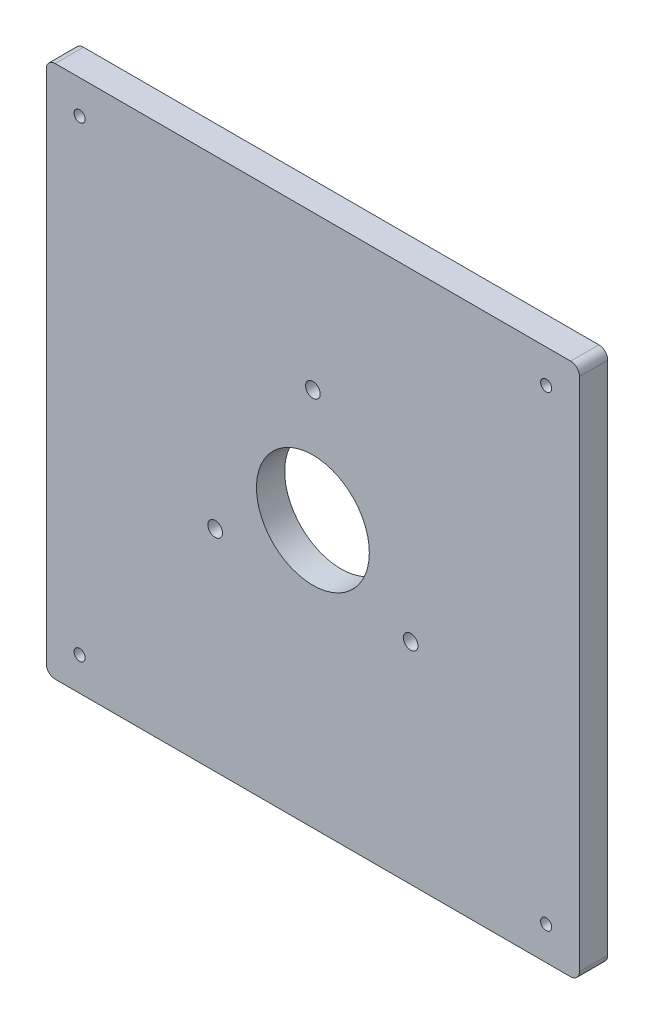
ISO-10303-21;
HEADER;
FILE_DESCRIPTION(('STEP AP214'),'2;1');
FILE_NAME('part.step','',(''),(''),'','','');
FILE_SCHEMA(('AUTOMOTIVE_DESIGN { 1 0 10303 214 1 1 1 1 }'));
ENDSEC;
DATA;
#1=APPLICATION_CONTEXT('core data for automotive mechanical design processes');
#2=APPLICATION_PROTOCOL_DEFINITION('international standard','automotive_design',2000,#1);
#3=PRODUCT_CONTEXT('',#1,'mechanical');
#4=PRODUCT('Part','Part','',(#3));
#5=PRODUCT_RELATED_PRODUCT_CATEGORY('part','',(#4));
#6=PRODUCT_DEFINITION_FORMATION('','',#4);
#7=PRODUCT_DEFINITION_CONTEXT('part definition',#1,'design');
#8=PRODUCT_DEFINITION('design','',#6,#7);
#9=PRODUCT_DEFINITION_SHAPE('','',#8);
#10=(LENGTH_UNIT() NAMED_UNIT(*) SI_UNIT(.MILLI.,.METRE.));
#11=(NAMED_UNIT(*) PLANE_ANGLE_UNIT() SI_UNIT($,.RADIAN.));
#12=(NAMED_UNIT(*) SI_UNIT($,.STERADIAN.) SOLID_ANGLE_UNIT());
#13=UNCERTAINTY_MEASURE_WITH_UNIT(LENGTH_MEASURE(1.E-05),#10,'distance_accuracy_value','');
#14=(GEOMETRIC_REPRESENTATION_CONTEXT(3) GLOBAL_UNCERTAINTY_ASSIGNED_CONTEXT((#13)) GLOBAL_UNIT_ASSIGNED_CONTEXT((#10,
#11,#12)) REPRESENTATION_CONTEXT('',''));
#15=CARTESIAN_POINT('',(0.,0.,0.));
#16=DIRECTION('',(0.,0.,1.));
#17=DIRECTION('',(1.,0.,0.));
#18=AXIS2_PLACEMENT_3D('',#15,#16,#17);
#19=CARTESIAN_POINT('',(0.,0.,6.35));
#20=DIRECTION('',(0.,0.,-1.));
#21=DIRECTION('',(-1.,0.,0.));
#22=AXIS2_PLACEMENT_3D('',#19,#20,#21);
#23=PLANE('',#22);
#24=CARTESIAN_POINT('',(81.9970452561247,47.2999999999999,6.35));
#25=DIRECTION('',(0.,0.,1.));
#26=DIRECTION('',(1.,0.,0.));
#27=AXIS2_PLACEMENT_3D('',#24,#25,#26);
#28=CIRCLE('',#27,1.65000000000001);
#29=CARTESIAN_POINT('',(83.6470452561247,47.2999999999999,6.35));
#30=VERTEX_POINT('',#29);
#31=EDGE_CURVE('E365',#30,#30,#28,.T.);
#32=ORIENTED_EDGE('',*,*,#31,.F.);
#33=EDGE_LOOP('',(#32));
#34=FACE_BOUND('',#33,.T.);
#35=CARTESIAN_POINT('',(38.0029547438753,47.2999999999999,6.35));
#36=DIRECTION('',(0.,0.,1.));
#37=DIRECTION('',(1.,0.,0.));
#38=AXIS2_PLACEMENT_3D('',#35,#36,#37);
#39=CIRCLE('',#38,1.65);
#40=CARTESIAN_POINT('',(39.6529547438753,47.2999999999999,6.35));
#41=VERTEX_POINT('',#40);
#42=EDGE_CURVE('E366',#41,#41,#39,.T.);
#43=ORIENTED_EDGE('',*,*,#42,.F.);
#44=EDGE_LOOP('',(#43));
#45=FACE_BOUND('',#44,.T.);
#46=CARTESIAN_POINT('',(60.,85.4,6.35));
#47=DIRECTION('',(0.,0.,1.));
#48=DIRECTION('',(1.,0.,0.));
#49=AXIS2_PLACEMENT_3D('',#46,#47,#48);
#50=CIRCLE('',#49,1.65);
#51=CARTESIAN_POINT('',(61.65,85.4,6.35));
#52=VERTEX_POINT('',#51);
#53=EDGE_CURVE('E374',#52,#52,#50,.T.);
#54=ORIENTED_EDGE('',*,*,#53,.F.);
#55=EDGE_LOOP('',(#54));
#56=FACE_BOUND('',#55,.T.);
#57=DIRECTION('',(0.,-1.,0.));
#58=VECTOR('',#57,1.);
#59=CARTESIAN_POINT('',(0.,0.,6.35));
#60=LINE('',#59,#58);
#61=CARTESIAN_POINT('',(0.,118.,6.35));
#62=VERTEX_POINT('',#61);
#63=CARTESIAN_POINT('',(0.,2.,6.35));
#64=VERTEX_POINT('',#63);
#65=EDGE_CURVE('E138',#62,#64,#60,.T.);
#66=ORIENTED_EDGE('',*,*,#65,.T.);
#67=CARTESIAN_POINT('',(2.,2.,6.35));
#68=DIRECTION('',(0.,0.,-1.));
#69=DIRECTION('',(-1.,0.,0.));
#70=AXIS2_PLACEMENT_3D('',#67,#68,#69);
#71=CIRCLE('',#70,2.);
#72=CARTESIAN_POINT('',(2.,0.,6.35));
#73=VERTEX_POINT('',#72);
#74=EDGE_CURVE('E153',#64,#73,#71,.F.);
#75=ORIENTED_EDGE('',*,*,#74,.T.);
#76=DIRECTION('',(1.,0.,0.));
#77=VECTOR('',#76,1.);
#78=CARTESIAN_POINT('',(0.,0.,6.35));
#79=LINE('',#78,#77);
#80=CARTESIAN_POINT('',(118.,0.,6.35));
#81=VERTEX_POINT('',#80);
#82=EDGE_CURVE('E120',#73,#81,#79,.T.);
#83=ORIENTED_EDGE('',*,*,#82,.T.);
#84=CARTESIAN_POINT('',(118.,2.,6.35));
#85=DIRECTION('',(0.,0.,-1.));
#86=DIRECTION('',(-1.,0.,0.));
#87=AXIS2_PLACEMENT_3D('',#84,#85,#86);
#88=CIRCLE('',#87,2.);
#89=CARTESIAN_POINT('',(120.,2.,6.35));
#90=VERTEX_POINT('',#89);
#91=EDGE_CURVE('E151',#81,#90,#88,.F.);
#92=ORIENTED_EDGE('',*,*,#91,.T.);
#93=DIRECTION('',(0.,1.,0.));
#94=VECTOR('',#93,1.);
#95=CARTESIAN_POINT('',(120.,0.,6.35));
#96=LINE('',#95,#94);
#97=CARTESIAN_POINT('',(120.,118.,6.35));
#98=VERTEX_POINT('',#97);
#99=EDGE_CURVE('E173',#90,#98,#96,.T.);
#100=ORIENTED_EDGE('',*,*,#99,.T.);
#101=CARTESIAN_POINT('',(118.,118.,6.35));
#102=DIRECTION('',(0.,0.,-1.));
#103=DIRECTION('',(-1.,0.,0.));
#104=AXIS2_PLACEMENT_3D('',#101,#102,#103);
#105=CIRCLE('',#104,2.);
#106=CARTESIAN_POINT('',(118.,120.,6.35));
#107=VERTEX_POINT('',#106);
#108=EDGE_CURVE('E55',#98,#107,#105,.F.);
#109=ORIENTED_EDGE('',*,*,#108,.T.);
#110=DIRECTION('',(-1.,0.,0.));
#111=VECTOR('',#110,1.);
#112=CARTESIAN_POINT('',(0.,120.,6.35));
#113=LINE('',#112,#111);
#114=CARTESIAN_POINT('',(2.,120.,6.35));
#115=VERTEX_POINT('',#114);
#116=EDGE_CURVE('E139',#107,#115,#113,.T.);
#117=ORIENTED_EDGE('',*,*,#116,.T.);
#118=CARTESIAN_POINT('',(2.,118.,6.35));
#119=DIRECTION('',(0.,0.,-1.));
#120=DIRECTION('',(-1.,0.,0.));
#121=AXIS2_PLACEMENT_3D('',#118,#119,#120);
#122=CIRCLE('',#121,2.);
#123=EDGE_CURVE('E149',#115,#62,#122,.F.);
#124=ORIENTED_EDGE('',*,*,#123,.T.);
#125=EDGE_LOOP('',(#66,#75,#83,#92,#100,#109,#117,#124));
#126=FACE_BOUND('',#125,.T.);
#127=CARTESIAN_POINT('',(7.5,112.5,6.35));
#128=DIRECTION('',(0.,0.,1.));
#129=DIRECTION('',(1.,0.,0.));
#130=AXIS2_PLACEMENT_3D('',#127,#128,#129);
#131=CIRCLE('',#130,1.25);
#132=CARTESIAN_POINT('',(8.75,112.5,6.35));
#133=VERTEX_POINT('',#132);
#134=EDGE_CURVE('E133',#133,#133,#131,.T.);
#135=ORIENTED_EDGE('',*,*,#134,.F.);
#136=EDGE_LOOP('',(#135));
#137=FACE_BOUND('',#136,.T.);
#138=CARTESIAN_POINT('',(112.5,112.5,6.35));
#139=DIRECTION('',(0.,0.,1.));
#140=DIRECTION('',(-1.,0.,0.));
#141=AXIS2_PLACEMENT_3D('',#138,#139,#140);
#142=CIRCLE('',#141,1.24999999999998);
#143=CARTESIAN_POINT('',(111.25,112.5,6.35));
#144=VERTEX_POINT('',#143);
#145=EDGE_CURVE('E189',#144,#144,#142,.T.);
#146=ORIENTED_EDGE('',*,*,#145,.F.);
#147=EDGE_LOOP('',(#146));
#148=FACE_BOUND('',#147,.T.);
#149=CARTESIAN_POINT('',(112.5,7.49999999999999,6.35));
#150=DIRECTION('',(0.,0.,1.));
#151=DIRECTION('',(1.,0.,0.));
#152=AXIS2_PLACEMENT_3D('',#149,#150,#151);
#153=CIRCLE('',#152,1.24999999999998);
#154=CARTESIAN_POINT('',(113.75,7.49999999999999,6.35));
#155=VERTEX_POINT('',#154);
#156=EDGE_CURVE('E193',#155,#155,#153,.T.);
#157=ORIENTED_EDGE('',*,*,#156,.F.);
#158=EDGE_LOOP('',(#157));
#159=FACE_BOUND('',#158,.T.);
#160=CARTESIAN_POINT('',(7.5,7.49999999999999,6.35));
#161=DIRECTION('',(0.,0.,1.));
#162=DIRECTION('',(-1.,0.,0.));
#163=AXIS2_PLACEMENT_3D('',#160,#161,#162);
#164=CIRCLE('',#163,1.25);
#165=CARTESIAN_POINT('',(6.25,7.49999999999999,6.35));
#166=VERTEX_POINT('',#165);
#167=EDGE_CURVE('E197',#166,#166,#164,.T.);
#168=ORIENTED_EDGE('',*,*,#167,.F.);
#169=EDGE_LOOP('',(#168));
#170=FACE_BOUND('',#169,.T.);
#171=CARTESIAN_POINT('',(60.,60.,6.35));
#172=DIRECTION('',(0.,0.,1.));
#173=DIRECTION('',(1.,0.,0.));
#174=AXIS2_PLACEMENT_3D('',#171,#172,#173);
#175=CIRCLE('',#174,12.7);
#176=CARTESIAN_POINT('',(72.7,60.,6.35));
#177=VERTEX_POINT('',#176);
#178=EDGE_CURVE('E200',#177,#177,#175,.T.);
#179=ORIENTED_EDGE('',*,*,#178,.F.);
#180=EDGE_LOOP('',(#179));
#181=FACE_BOUND('',#180,.T.);
#182=ADVANCED_FACE('F35',(#34,#45,#56,#126,#137,#148,#159,#170,#181),#23,.F.);
#183=CARTESIAN_POINT('',(0.,0.,0.));
#184=DIRECTION('',(0.,0.,-1.));
#185=DIRECTION('',(-1.,0.,0.));
#186=AXIS2_PLACEMENT_3D('',#183,#184,#185);
#187=PLANE('',#186);
#188=CARTESIAN_POINT('',(81.9970452561247,47.2999999999999,0.));
#189=DIRECTION('',(0.,0.,1.));
#190=DIRECTION('',(1.,0.,0.));
#191=AXIS2_PLACEMENT_3D('',#188,#189,#190);
#192=CIRCLE('',#191,1.65000000000001);
#193=CARTESIAN_POINT('',(83.6470452561247,47.2999999999999,0.));
#194=VERTEX_POINT('',#193);
#195=EDGE_CURVE('E208',#194,#194,#192,.T.);
#196=ORIENTED_EDGE('',*,*,#195,.T.);
#197=EDGE_LOOP('',(#196));
#198=FACE_BOUND('',#197,.T.);
#199=CARTESIAN_POINT('',(38.0029547438753,47.2999999999999,0.));
#200=DIRECTION('',(0.,0.,1.));
#201=DIRECTION('',(1.,0.,0.));
#202=AXIS2_PLACEMENT_3D('',#199,#200,#201);
#203=CIRCLE('',#202,1.65);
#204=CARTESIAN_POINT('',(39.6529547438753,47.2999999999999,0.));
#205=VERTEX_POINT('',#204);
#206=EDGE_CURVE('E370',#205,#205,#203,.T.);
#207=ORIENTED_EDGE('',*,*,#206,.T.);
#208=EDGE_LOOP('',(#207));
#209=FACE_BOUND('',#208,.T.);
#210=CARTESIAN_POINT('',(60.,85.4,0.));
#211=DIRECTION('',(0.,0.,1.));
#212=DIRECTION('',(1.,0.,0.));
#213=AXIS2_PLACEMENT_3D('',#210,#211,#212);
#214=CIRCLE('',#213,1.65);
#215=CARTESIAN_POINT('',(61.65,85.4,0.));
#216=VERTEX_POINT('',#215);
#217=EDGE_CURVE('E211',#216,#216,#214,.T.);
#218=ORIENTED_EDGE('',*,*,#217,.T.);
#219=EDGE_LOOP('',(#218));
#220=FACE_BOUND('',#219,.T.);
#221=CARTESIAN_POINT('',(7.5,7.49999999999999,0.));
#222=DIRECTION('',(0.,0.,1.));
#223=DIRECTION('',(-1.,0.,0.));
#224=AXIS2_PLACEMENT_3D('',#221,#222,#223);
#225=CIRCLE('',#224,1.25);
#226=CARTESIAN_POINT('',(6.25,7.49999999999999,0.));
#227=VERTEX_POINT('',#226);
#228=EDGE_CURVE('E202',#227,#227,#225,.T.);
#229=ORIENTED_EDGE('',*,*,#228,.T.);
#230=EDGE_LOOP('',(#229));
#231=FACE_BOUND('',#230,.T.);
#232=CARTESIAN_POINT('',(112.5,112.5,0.));
#233=DIRECTION('',(0.,0.,1.));
#234=DIRECTION('',(-1.,0.,0.));
#235=AXIS2_PLACEMENT_3D('',#232,#233,#234);
#236=CIRCLE('',#235,1.24999999999998);
#237=CARTESIAN_POINT('',(111.25,112.5,0.));
#238=VERTEX_POINT('',#237);
#239=EDGE_CURVE('E217',#238,#238,#236,.T.);
#240=ORIENTED_EDGE('',*,*,#239,.T.);
#241=EDGE_LOOP('',(#240));
#242=FACE_BOUND('',#241,.T.);
#243=DIRECTION('',(1.,0.,0.));
#244=VECTOR('',#243,1.);
#245=CARTESIAN_POINT('',(0.,0.,0.));
#246=LINE('',#245,#244);
#247=CARTESIAN_POINT('',(2.,0.,0.));
#248=VERTEX_POINT('',#247);
#249=CARTESIAN_POINT('',(118.,0.,0.));
#250=VERTEX_POINT('',#249);
#251=EDGE_CURVE('E117',#248,#250,#246,.T.);
#252=ORIENTED_EDGE('',*,*,#251,.F.);
#253=CARTESIAN_POINT('',(2.,2.,0.));
#254=DIRECTION('',(0.,0.,-1.));
#255=DIRECTION('',(-1.,0.,0.));
#256=AXIS2_PLACEMENT_3D('',#253,#254,#255);
#257=CIRCLE('',#256,2.);
#258=CARTESIAN_POINT('',(0.,2.,0.));
#259=VERTEX_POINT('',#258);
#260=EDGE_CURVE('E100',#248,#259,#257,.T.);
#261=ORIENTED_EDGE('',*,*,#260,.T.);
#262=DIRECTION('',(0.,-1.,0.));
#263=VECTOR('',#262,1.);
#264=CARTESIAN_POINT('',(0.,0.,0.));
#265=LINE('',#264,#263);
#266=CARTESIAN_POINT('',(0.,118.,0.));
#267=VERTEX_POINT('',#266);
#268=EDGE_CURVE('E128',#267,#259,#265,.T.);
#269=ORIENTED_EDGE('',*,*,#268,.F.);
#270=CARTESIAN_POINT('',(2.,118.,0.));
#271=DIRECTION('',(0.,0.,-1.));
#272=DIRECTION('',(-1.,0.,0.));
#273=AXIS2_PLACEMENT_3D('',#270,#271,#272);
#274=CIRCLE('',#273,2.);
#275=CARTESIAN_POINT('',(2.,120.,0.));
#276=VERTEX_POINT('',#275);
#277=EDGE_CURVE('E142',#267,#276,#274,.T.);
#278=ORIENTED_EDGE('',*,*,#277,.T.);
#279=DIRECTION('',(-1.,0.,0.));
#280=VECTOR('',#279,1.);
#281=CARTESIAN_POINT('',(0.,120.,0.));
#282=LINE('',#281,#280);
#283=CARTESIAN_POINT('',(118.,120.,0.));
#284=VERTEX_POINT('',#283);
#285=EDGE_CURVE('E131',#284,#276,#282,.T.);
#286=ORIENTED_EDGE('',*,*,#285,.F.);
#287=CARTESIAN_POINT('',(118.,118.,0.));
#288=DIRECTION('',(0.,0.,-1.));
#289=DIRECTION('',(-1.,0.,0.));
#290=AXIS2_PLACEMENT_3D('',#287,#288,#289);
#291=CIRCLE('',#290,2.);
#292=CARTESIAN_POINT('',(120.,118.,0.));
#293=VERTEX_POINT('',#292);
#294=EDGE_CURVE('E121',#284,#293,#291,.T.);
#295=ORIENTED_EDGE('',*,*,#294,.T.);
#296=DIRECTION('',(0.,1.,0.));
#297=VECTOR('',#296,1.);
#298=CARTESIAN_POINT('',(120.,0.,0.));
#299=LINE('',#298,#297);
#300=CARTESIAN_POINT('',(120.,2.,0.));
#301=VERTEX_POINT('',#300);
#302=EDGE_CURVE('E127',#301,#293,#299,.T.);
#303=ORIENTED_EDGE('',*,*,#302,.F.);
#304=CARTESIAN_POINT('',(118.,2.,0.));
#305=DIRECTION('',(0.,0.,-1.));
#306=DIRECTION('',(-1.,0.,0.));
#307=AXIS2_PLACEMENT_3D('',#304,#305,#306);
#308=CIRCLE('',#307,2.);
#309=EDGE_CURVE('E111',#301,#250,#308,.T.);
#310=ORIENTED_EDGE('',*,*,#309,.T.);
#311=EDGE_LOOP('',(#252,#261,#269,#278,#286,#295,#303,#310));
#312=FACE_BOUND('',#311,.T.);
#313=CARTESIAN_POINT('',(7.5,112.5,0.));
#314=DIRECTION('',(0.,0.,1.));
#315=DIRECTION('',(1.,0.,0.));
#316=AXIS2_PLACEMENT_3D('',#313,#314,#315);
#317=CIRCLE('',#316,1.25);
#318=CARTESIAN_POINT('',(8.75,112.5,0.));
#319=VERTEX_POINT('',#318);
#320=EDGE_CURVE('E176',#319,#319,#317,.T.);
#321=ORIENTED_EDGE('',*,*,#320,.T.);
#322=EDGE_LOOP('',(#321));
#323=FACE_BOUND('',#322,.T.);
#324=CARTESIAN_POINT('',(112.5,7.49999999999999,0.));
#325=DIRECTION('',(0.,0.,1.));
#326=DIRECTION('',(1.,0.,0.));
#327=AXIS2_PLACEMENT_3D('',#324,#325,#326);
#328=CIRCLE('',#327,1.24999999999998);
#329=CARTESIAN_POINT('',(113.75,7.49999999999999,0.));
#330=VERTEX_POINT('',#329);
#331=EDGE_CURVE('E214',#330,#330,#328,.T.);
#332=ORIENTED_EDGE('',*,*,#331,.T.);
#333=EDGE_LOOP('',(#332));
#334=FACE_BOUND('',#333,.T.);
#335=CARTESIAN_POINT('',(60.,60.,0.));
#336=DIRECTION('',(0.,0.,1.));
#337=DIRECTION('',(1.,0.,0.));
#338=AXIS2_PLACEMENT_3D('',#335,#336,#337);
#339=CIRCLE('',#338,12.7);
#340=CARTESIAN_POINT('',(72.7,60.,0.));
#341=VERTEX_POINT('',#340);
#342=EDGE_CURVE('E203',#341,#341,#339,.T.);
#343=ORIENTED_EDGE('',*,*,#342,.T.);
#344=EDGE_LOOP('',(#343));
#345=FACE_BOUND('',#344,.T.);
#346=ADVANCED_FACE('F124',(#198,#209,#220,#231,#242,#312,#323,#334,#345),#187,.T.);
#347=CARTESIAN_POINT('',(0.,0.,6.35));
#348=DIRECTION('',(1.,0.,0.));
#349=DIRECTION('',(0.,0.,-1.));
#350=AXIS2_PLACEMENT_3D('',#347,#348,#349);
#351=PLANE('',#350);
#352=ORIENTED_EDGE('',*,*,#268,.T.);
#353=DIRECTION('',(0.,0.,-1.));
#354=VECTOR('',#353,1.);
#355=CARTESIAN_POINT('',(0.,2.,6.35));
#356=LINE('',#355,#354);
#357=EDGE_CURVE('E105',#259,#64,#356,.F.);
#358=ORIENTED_EDGE('',*,*,#357,.T.);
#359=ORIENTED_EDGE('',*,*,#65,.F.);
#360=DIRECTION('',(0.,0.,-1.));
#361=VECTOR('',#360,1.);
#362=CARTESIAN_POINT('',(0.,118.,6.35));
#363=LINE('',#362,#361);
#364=EDGE_CURVE('E110',#62,#267,#363,.T.);
#365=ORIENTED_EDGE('',*,*,#364,.T.);
#366=EDGE_LOOP('',(#352,#358,#359,#365));
#367=FACE_BOUND('',#366,.T.);
#368=ADVANCED_FACE('F170',(#367),#351,.F.);
#369=CARTESIAN_POINT('',(0.,0.,6.35));
#370=DIRECTION('',(0.,1.,0.));
#371=DIRECTION('',(0.,0.,1.));
#372=AXIS2_PLACEMENT_3D('',#369,#370,#371);
#373=PLANE('',#372);
#374=ORIENTED_EDGE('',*,*,#82,.F.);
#375=DIRECTION('',(0.,0.,-1.));
#376=VECTOR('',#375,1.);
#377=CARTESIAN_POINT('',(2.,0.,6.35));
#378=LINE('',#377,#376);
#379=EDGE_CURVE('E104',#73,#248,#378,.T.);
#380=ORIENTED_EDGE('',*,*,#379,.T.);
#381=ORIENTED_EDGE('',*,*,#251,.T.);
#382=DIRECTION('',(0.,0.,-1.));
#383=VECTOR('',#382,1.);
#384=CARTESIAN_POINT('',(118.,0.,6.35));
#385=LINE('',#384,#383);
#386=EDGE_CURVE('E122',#250,#81,#385,.F.);
#387=ORIENTED_EDGE('',*,*,#386,.T.);
#388=EDGE_LOOP('',(#374,#380,#381,#387));
#389=FACE_BOUND('',#388,.T.);
#390=ADVANCED_FACE('F116',(#389),#373,.F.);
#391=CARTESIAN_POINT('',(120.,0.,6.35));
#392=DIRECTION('',(-1.,0.,0.));
#393=DIRECTION('',(0.,0.,1.));
#394=AXIS2_PLACEMENT_3D('',#391,#392,#393);
#395=PLANE('',#394);
#396=ORIENTED_EDGE('',*,*,#99,.F.);
#397=DIRECTION('',(0.,0.,-1.));
#398=VECTOR('',#397,1.);
#399=CARTESIAN_POINT('',(120.,2.,6.35));
#400=LINE('',#399,#398);
#401=EDGE_CURVE('E157',#90,#301,#400,.T.);
#402=ORIENTED_EDGE('',*,*,#401,.T.);
#403=ORIENTED_EDGE('',*,*,#302,.T.);
#404=DIRECTION('',(0.,0.,-1.));
#405=VECTOR('',#404,1.);
#406=CARTESIAN_POINT('',(120.,118.,6.35));
#407=LINE('',#406,#405);
#408=EDGE_CURVE('E155',#293,#98,#407,.F.);
#409=ORIENTED_EDGE('',*,*,#408,.T.);
#410=EDGE_LOOP('',(#396,#402,#403,#409));
#411=FACE_BOUND('',#410,.T.);
#412=ADVANCED_FACE('F238',(#411),#395,.F.);
#413=CARTESIAN_POINT('',(0.,120.,6.35));
#414=DIRECTION('',(0.,-1.,0.));
#415=DIRECTION('',(0.,0.,-1.));
#416=AXIS2_PLACEMENT_3D('',#413,#414,#415);
#417=PLANE('',#416);
#418=ORIENTED_EDGE('',*,*,#285,.T.);
#419=DIRECTION('',(0.,0.,-1.));
#420=VECTOR('',#419,1.);
#421=CARTESIAN_POINT('',(2.,120.,6.35));
#422=LINE('',#421,#420);
#423=EDGE_CURVE('E11',#276,#115,#422,.F.);
#424=ORIENTED_EDGE('',*,*,#423,.T.);
#425=ORIENTED_EDGE('',*,*,#116,.F.);
#426=DIRECTION('',(0.,0.,-1.));
#427=VECTOR('',#426,1.);
#428=CARTESIAN_POINT('',(118.,120.,6.35));
#429=LINE('',#428,#427);
#430=EDGE_CURVE('E43',#107,#284,#429,.T.);
#431=ORIENTED_EDGE('',*,*,#430,.T.);
#432=EDGE_LOOP('',(#418,#424,#425,#431));
#433=FACE_BOUND('',#432,.T.);
#434=ADVANCED_FACE('F162',(#433),#417,.F.);
#435=CARTESIAN_POINT('',(7.5,112.5,6.35));
#436=DIRECTION('',(0.,0.,-1.));
#437=DIRECTION('',(-1.,0.,0.));
#438=AXIS2_PLACEMENT_3D('',#435,#436,#437);
#439=CYLINDRICAL_SURFACE('',#438,1.25);
#440=ORIENTED_EDGE('',*,*,#134,.T.);
#441=EDGE_LOOP('',(#440));
#442=FACE_BOUND('',#441,.T.);
#443=ORIENTED_EDGE('',*,*,#320,.F.);
#444=EDGE_LOOP('',(#443));
#445=FACE_BOUND('',#444,.T.);
#446=ADVANCED_FACE('F227',(#442,#445),#439,.F.);
#447=CARTESIAN_POINT('',(112.5,112.5,6.35));
#448=DIRECTION('',(0.,0.,-1.));
#449=DIRECTION('',(-1.,0.,0.));
#450=AXIS2_PLACEMENT_3D('',#447,#448,#449);
#451=CYLINDRICAL_SURFACE('',#450,1.24999999999998);
#452=ORIENTED_EDGE('',*,*,#145,.T.);
#453=EDGE_LOOP('',(#452));
#454=FACE_BOUND('',#453,.T.);
#455=ORIENTED_EDGE('',*,*,#239,.F.);
#456=EDGE_LOOP('',(#455));
#457=FACE_BOUND('',#456,.T.);
#458=ADVANCED_FACE('F229',(#454,#457),#451,.F.);
#459=CARTESIAN_POINT('',(112.5,7.49999999999999,6.35));
#460=DIRECTION('',(0.,0.,-1.));
#461=DIRECTION('',(-1.,0.,0.));
#462=AXIS2_PLACEMENT_3D('',#459,#460,#461);
#463=CYLINDRICAL_SURFACE('',#462,1.24999999999998);
#464=ORIENTED_EDGE('',*,*,#156,.T.);
#465=EDGE_LOOP('',(#464));
#466=FACE_BOUND('',#465,.T.);
#467=ORIENTED_EDGE('',*,*,#331,.F.);
#468=EDGE_LOOP('',(#467));
#469=FACE_BOUND('',#468,.T.);
#470=ADVANCED_FACE('F235',(#466,#469),#463,.F.);
#471=CARTESIAN_POINT('',(7.5,7.49999999999999,6.35));
#472=DIRECTION('',(0.,0.,-1.));
#473=DIRECTION('',(-1.,0.,0.));
#474=AXIS2_PLACEMENT_3D('',#471,#472,#473);
#475=CYLINDRICAL_SURFACE('',#474,1.25);
#476=ORIENTED_EDGE('',*,*,#167,.T.);
#477=EDGE_LOOP('',(#476));
#478=FACE_BOUND('',#477,.T.);
#479=ORIENTED_EDGE('',*,*,#228,.F.);
#480=EDGE_LOOP('',(#479));
#481=FACE_BOUND('',#480,.T.);
#482=ADVANCED_FACE('F285',(#478,#481),#475,.F.);
#483=CARTESIAN_POINT('',(60.,60.,6.35));
#484=DIRECTION('',(0.,0.,-1.));
#485=DIRECTION('',(-1.,0.,0.));
#486=AXIS2_PLACEMENT_3D('',#483,#484,#485);
#487=CYLINDRICAL_SURFACE('',#486,12.7);
#488=ORIENTED_EDGE('',*,*,#178,.T.);
#489=EDGE_LOOP('',(#488));
#490=FACE_BOUND('',#489,.T.);
#491=ORIENTED_EDGE('',*,*,#342,.F.);
#492=EDGE_LOOP('',(#491));
#493=FACE_BOUND('',#492,.T.);
#494=ADVANCED_FACE('F255',(#490,#493),#487,.F.);
#495=CARTESIAN_POINT('',(2.,2.,6.35));
#496=DIRECTION('',(0.,0.,-1.));
#497=DIRECTION('',(-1.,0.,0.));
#498=AXIS2_PLACEMENT_3D('',#495,#496,#497);
#499=CYLINDRICAL_SURFACE('',#498,2.);
#500=ORIENTED_EDGE('',*,*,#74,.F.);
#501=ORIENTED_EDGE('',*,*,#357,.F.);
#502=ORIENTED_EDGE('',*,*,#260,.F.);
#503=ORIENTED_EDGE('',*,*,#379,.F.);
#504=EDGE_LOOP('',(#500,#501,#502,#503));
#505=FACE_BOUND('',#504,.T.);
#506=ADVANCED_FACE('F103',(#505),#499,.T.);
#507=CARTESIAN_POINT('',(118.,2.,6.35));
#508=DIRECTION('',(0.,0.,-1.));
#509=DIRECTION('',(-1.,0.,0.));
#510=AXIS2_PLACEMENT_3D('',#507,#508,#509);
#511=CYLINDRICAL_SURFACE('',#510,2.);
#512=ORIENTED_EDGE('',*,*,#91,.F.);
#513=ORIENTED_EDGE('',*,*,#386,.F.);
#514=ORIENTED_EDGE('',*,*,#309,.F.);
#515=ORIENTED_EDGE('',*,*,#401,.F.);
#516=EDGE_LOOP('',(#512,#513,#514,#515));
#517=FACE_BOUND('',#516,.T.);
#518=ADVANCED_FACE('F254',(#517),#511,.T.);
#519=CARTESIAN_POINT('',(2.,118.,6.35));
#520=DIRECTION('',(0.,0.,-1.));
#521=DIRECTION('',(-1.,0.,0.));
#522=AXIS2_PLACEMENT_3D('',#519,#520,#521);
#523=CYLINDRICAL_SURFACE('',#522,2.);
#524=ORIENTED_EDGE('',*,*,#123,.F.);
#525=ORIENTED_EDGE('',*,*,#423,.F.);
#526=ORIENTED_EDGE('',*,*,#277,.F.);
#527=ORIENTED_EDGE('',*,*,#364,.F.);
#528=EDGE_LOOP('',(#524,#525,#526,#527));
#529=FACE_BOUND('',#528,.T.);
#530=ADVANCED_FACE('F167',(#529),#523,.T.);
#531=CARTESIAN_POINT('',(118.,118.,6.35));
#532=DIRECTION('',(0.,0.,-1.));
#533=DIRECTION('',(-1.,0.,0.));
#534=AXIS2_PLACEMENT_3D('',#531,#532,#533);
#535=CYLINDRICAL_SURFACE('',#534,2.);
#536=ORIENTED_EDGE('',*,*,#108,.F.);
#537=ORIENTED_EDGE('',*,*,#408,.F.);
#538=ORIENTED_EDGE('',*,*,#294,.F.);
#539=ORIENTED_EDGE('',*,*,#430,.F.);
#540=EDGE_LOOP('',(#536,#537,#538,#539));
#541=FACE_BOUND('',#540,.T.);
#542=ADVANCED_FACE('F37',(#541),#535,.T.);
#543=CARTESIAN_POINT('',(60.,85.4,0.));
#544=DIRECTION('',(0.,0.,1.));
#545=DIRECTION('',(1.,0.,0.));
#546=AXIS2_PLACEMENT_3D('',#543,#544,#545);
#547=CYLINDRICAL_SURFACE('',#546,1.65);
#548=ORIENTED_EDGE('',*,*,#217,.F.);
#549=EDGE_LOOP('',(#548));
#550=FACE_BOUND('',#549,.T.);
#551=ORIENTED_EDGE('',*,*,#53,.T.);
#552=EDGE_LOOP('',(#551));
#553=FACE_BOUND('',#552,.T.);
#554=ADVANCED_FACE('F262',(#550,#553),#547,.F.);
#555=CARTESIAN_POINT('',(38.0029547438753,47.2999999999999,0.));
#556=DIRECTION('',(0.,0.,1.));
#557=DIRECTION('',(1.,0.,0.));
#558=AXIS2_PLACEMENT_3D('',#555,#556,#557);
#559=CYLINDRICAL_SURFACE('',#558,1.65);
#560=ORIENTED_EDGE('',*,*,#206,.F.);
#561=EDGE_LOOP('',(#560));
#562=FACE_BOUND('',#561,.T.);
#563=ORIENTED_EDGE('',*,*,#42,.T.);
#564=EDGE_LOOP('',(#563));
#565=FACE_BOUND('',#564,.T.);
#566=ADVANCED_FACE('F266',(#562,#565),#559,.F.);
#567=CARTESIAN_POINT('',(81.9970452561247,47.2999999999999,0.));
#568=DIRECTION('',(0.,0.,1.));
#569=DIRECTION('',(1.,0.,0.));
#570=AXIS2_PLACEMENT_3D('',#567,#568,#569);
#571=CYLINDRICAL_SURFACE('',#570,1.65000000000001);
#572=ORIENTED_EDGE('',*,*,#195,.F.);
#573=EDGE_LOOP('',(#572));
#574=FACE_BOUND('',#573,.T.);
#575=ORIENTED_EDGE('',*,*,#31,.T.);
#576=EDGE_LOOP('',(#575));
#577=FACE_BOUND('',#576,.T.);
#578=ADVANCED_FACE('F276',(#574,#577),#571,.F.);
#579=CLOSED_SHELL('',(#182,#346,#368,#390,#412,#434,#446,#458,#470,#482,#494,#506,#518,#530,
#542,#554,#566,#578));
#580=MANIFOLD_SOLID_BREP('B2',#579);
#581=ADVANCED_BREP_SHAPE_REPRESENTATION('',(#18,#580),#14);
#582=SHAPE_DEFINITION_REPRESENTATION(#9,#581);
ENDSEC;
END-ISO-10303-21;
